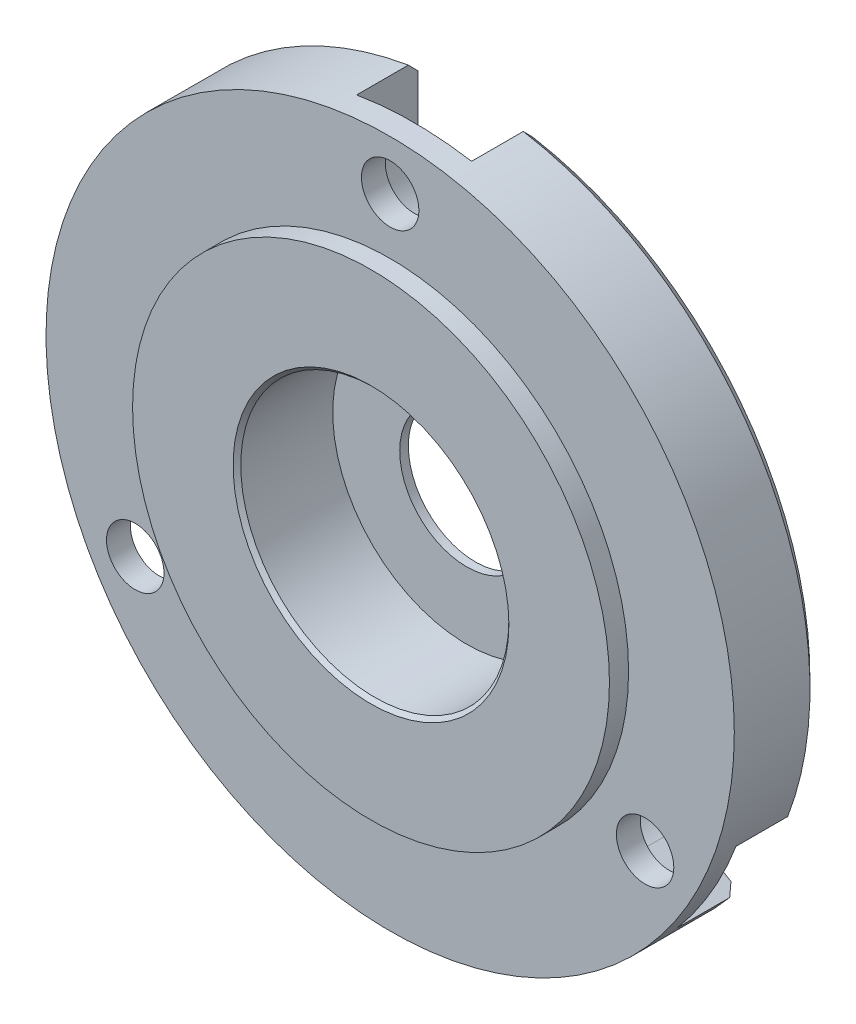
ISO-10303-21;
HEADER;
FILE_DESCRIPTION(('STEP AP214'),'2;1');
FILE_NAME('part.step','',(''),(''),'','','');
FILE_SCHEMA(('AUTOMOTIVE_DESIGN { 1 0 10303 214 1 1 1 1 }'));
ENDSEC;
DATA;
#1=APPLICATION_CONTEXT('core data for automotive mechanical design processes');
#2=APPLICATION_PROTOCOL_DEFINITION('international standard','automotive_design',2000,#1);
#3=PRODUCT_CONTEXT('',#1,'mechanical');
#4=PRODUCT('Part','Part','',(#3));
#5=PRODUCT_RELATED_PRODUCT_CATEGORY('part','',(#4));
#6=PRODUCT_DEFINITION_FORMATION('','',#4);
#7=PRODUCT_DEFINITION_CONTEXT('part definition',#1,'design');
#8=PRODUCT_DEFINITION('design','',#6,#7);
#9=PRODUCT_DEFINITION_SHAPE('','',#8);
#10=(LENGTH_UNIT() NAMED_UNIT(*) SI_UNIT(.MILLI.,.METRE.));
#11=(NAMED_UNIT(*) PLANE_ANGLE_UNIT() SI_UNIT($,.RADIAN.));
#12=(NAMED_UNIT(*) SI_UNIT($,.STERADIAN.) SOLID_ANGLE_UNIT());
#13=UNCERTAINTY_MEASURE_WITH_UNIT(LENGTH_MEASURE(1.E-05),#10,'distance_accuracy_value','');
#14=(GEOMETRIC_REPRESENTATION_CONTEXT(3) GLOBAL_UNCERTAINTY_ASSIGNED_CONTEXT((#13)) GLOBAL_UNIT_ASSIGNED_CONTEXT((#10,
#11,#12)) REPRESENTATION_CONTEXT('',''));
#15=CARTESIAN_POINT('',(0.,0.,0.));
#16=DIRECTION('',(0.,0.,1.));
#17=DIRECTION('',(1.,0.,0.));
#18=AXIS2_PLACEMENT_3D('',#15,#16,#17);
#19=CARTESIAN_POINT('',(-74.8422031977456,51.8720779220779,0.500000000000004));
#20=DIRECTION('',(0.,0.,1.));
#21=DIRECTION('',(1.,0.,0.));
#22=AXIS2_PLACEMENT_3D('',#19,#20,#21);
#23=CONICAL_SURFACE('',#22,17.97,0.785398163397448);
#24=CARTESIAN_POINT('',(-88.2002208778621,40.6134245524384,-0.000199999999997867));
#25=CARTESIAN_POINT('',(-88.2735733593311,40.5710744775165,0.0831814825688447));
#26=CARTESIAN_POINT('',(-88.3469179438918,40.5287289618768,0.166572223860307));
#27=CARTESIAN_POINT('',(-88.4935913191717,40.444047049176,0.333372223860313));
#28=CARTESIAN_POINT('',(-88.566920109891,40.4017106521149,0.416781482568851));
#29=CARTESIAN_POINT('',(-88.6402410037019,40.359378814336,0.500200000000002));
#30=B_SPLINE_CURVE_WITH_KNOTS('',3,(#24,#25,#26,#27,#28,#29),.UNSPECIFIED.,.F.,.F.,(4,2,4),(0.,
0.356565952680265,0.713131905240145),.UNSPECIFIED.);
#31=CARTESIAN_POINT('',(-88.2003968232458,40.6133229703238,0.));
#32=VERTEX_POINT('',#31);
#33=CARTESIAN_POINT('',(-88.6400652121353,40.3594803076443,0.500000000000008));
#34=VERTEX_POINT('',#33);
#35=EDGE_CURVE('E357',#32,#34,#30,.T.);
#36=ORIENTED_EDGE('',*,*,#35,.F.);
#37=CARTESIAN_POINT('',(-74.8422031977456,51.8720779220779,0.));
#38=DIRECTION('',(0.,0.,1.));
#39=DIRECTION('',(1.,0.,0.));
#40=AXIS2_PLACEMENT_3D('',#37,#38,#39);
#41=CIRCLE('',#40,17.47);
#42=CARTESIAN_POINT('',(-61.4977207946703,40.5970750664679,0.));
#43=VERTEX_POINT('',#42);
#44=EDGE_CURVE('E269',#43,#32,#41,.F.);
#45=ORIENTED_EDGE('',*,*,#44,.F.);
#46=CARTESIAN_POINT('',(-61.0635427554935,40.3361945810799,0.500200000000005));
#47=CARTESIAN_POINT('',(-61.1359218595241,40.3796843343324,0.416784823088143));
#48=CARTESIAN_POINT('',(-61.2083073868908,40.4231779471146,0.333377234636964));
#49=CARTESIAN_POINT('',(-61.3530912883131,40.5101728917485,0.166577234636959));
#50=CARTESIAN_POINT('',(-61.4254896623686,40.5536742236001,0.0831848230881354));
#51=CARTESIAN_POINT('',(-61.4978944597603,40.5971794149814,-0.000200000000000809));
#52=B_SPLINE_CURVE_WITH_KNOTS('',3,(#46,#47,#48,#49,#50,#51),.UNSPECIFIED.,.F.,.F.,(4,2,4),(0.,
0.356080977624851,0.712161955330887),.UNSPECIFIED.);
#53=CARTESIAN_POINT('',(-61.0637162958092,40.3362988546215,0.500000000000004));
#54=VERTEX_POINT('',#53);
#55=EDGE_CURVE('E371',#54,#43,#52,.T.);
#56=ORIENTED_EDGE('',*,*,#55,.F.);
#57=CARTESIAN_POINT('',(-74.8422031977456,51.8720779220779,0.500000000000004));
#58=DIRECTION('',(0.,0.,1.));
#59=DIRECTION('',(1.,0.,0.));
#60=AXIS2_PLACEMENT_3D('',#57,#58,#59);
#61=CIRCLE('',#60,17.97);
#62=EDGE_CURVE('E55',#34,#54,#61,.T.);
#63=ORIENTED_EDGE('',*,*,#62,.F.);
#64=EDGE_LOOP('',(#36,#45,#56,#63));
#65=FACE_BOUND('',#64,.T.);
#66=ADVANCED_FACE('F32',(#65),#23,.T.);
#67=CARTESIAN_POINT('',(-88.1530136539125,44.1870779220779,5.45));
#68=DIRECTION('',(0.,0.,-1.));
#69=DIRECTION('',(-1.,0.,0.));
#70=AXIS2_PLACEMENT_3D('',#67,#68,#69);
#71=CYLINDRICAL_SURFACE('',#70,1.50000000000001);
#72=CARTESIAN_POINT('',(-88.1530136539125,44.1870779220779,4.45));
#73=DIRECTION('',(0.,0.,1.));
#74=DIRECTION('',(1.,0.,0.));
#75=AXIS2_PLACEMENT_3D('',#72,#73,#74);
#76=CIRCLE('',#75,1.50000000000001);
#77=CARTESIAN_POINT('',(-86.6530136539124,44.1870779220779,4.45));
#78=VERTEX_POINT('',#77);
#79=EDGE_CURVE('E242',#78,#78,#76,.T.);
#80=ORIENTED_EDGE('',*,*,#79,.T.);
#81=EDGE_LOOP('',(#80));
#82=FACE_BOUND('',#81,.T.);
#83=CARTESIAN_POINT('',(-88.1530136539125,44.1870779220779,3.2));
#84=DIRECTION('',(0.,0.,-1.));
#85=DIRECTION('',(-1.,0.,0.));
#86=AXIS2_PLACEMENT_3D('',#83,#84,#85);
#87=CIRCLE('',#86,1.50000000000001);
#88=CARTESIAN_POINT('',(-89.6530136539125,44.1870779220779,3.2));
#89=VERTEX_POINT('',#88);
#90=EDGE_CURVE('E171',#89,#89,#87,.F.);
#91=ORIENTED_EDGE('',*,*,#90,.F.);
#92=EDGE_LOOP('',(#91));
#93=FACE_BOUND('',#92,.T.);
#94=ADVANCED_FACE('F311',(#82,#93),#71,.F.);
#95=CARTESIAN_POINT('',(-58.4699334263535,45.7775972573485,-0.000199999999999618));
#96=CARTESIAN_POINT('',(-58.3972269334165,45.7339107889951,0.083179707136008));
#97=CARTESIAN_POINT('',(-58.3245289939025,45.6902294600567,0.166569560712443));
#98=CARTESIAN_POINT('',(-58.1791502217499,45.6028770810276,0.333369560712453));
#99=CARTESIAN_POINT('',(-58.1064693891112,45.5592060309369,0.416779707136019));
#100=CARTESIAN_POINT('',(-58.0337971098956,45.5155401202612,0.500200000000005));
#101=B_SPLINE_CURVE_WITH_KNOTS('',3,(#95,#96,#97,#98,#99,#100),.UNSPECIFIED.,.F.,.F.,(4,2,4),
(0.,0.35682243382694,0.713644867509625),.UNSPECIFIED.);
#102=CARTESIAN_POINT('',(-58.4697590266398,45.7774924674286,0.));
#103=VERTEX_POINT('',#102);
#104=CARTESIAN_POINT('',(-58.0339713427646,45.5156448099307,0.500000000000008));
#105=VERTEX_POINT('',#104);
#106=EDGE_CURVE('E358',#103,#105,#101,.T.);
#107=ORIENTED_EDGE('',*,*,#106,.F.);
#108=CARTESIAN_POINT('',(-71.8422031977456,69.0825660034776,0.));
#109=VERTEX_POINT('',#108);
#110=EDGE_CURVE('E265',#109,#103,#41,.F.);
#111=ORIENTED_EDGE('',*,*,#110,.F.);
#112=CARTESIAN_POINT('',(-71.8422031977456,73.9510229847034,4.81182701392405));
#113=CARTESIAN_POINT('',(-71.8422031977456,73.188762335671,4.05656477941625));
#114=CARTESIAN_POINT('',(-71.8422031977456,72.4262004104416,3.30160534713981));
#115=CARTESIAN_POINT('',(-71.8422031977456,70.9000867576194,1.79269394851582));
#116=CARTESIAN_POINT('',(-71.8422031977456,70.1365350340635,1.0387419780846));
#117=CARTESIAN_POINT('',(-71.8422031977456,68.9901688084127,-0.0911347826652783));
#118=CARTESIAN_POINT('',(-71.8422031977456,68.6078730218659,-0.467585764161266));
#119=CARTESIAN_POINT('',(-71.8422031977456,67.8428519948834,-1.22005090566893));
#120=CARTESIAN_POINT('',(-71.8422031977456,67.4601267545847,-1.59606506581993));
#121=CARTESIAN_POINT('',(-71.8422031977456,66.6941483008052,-2.34755852838192));
#122=CARTESIAN_POINT('',(-71.8422031977456,66.3108950851956,-2.72303782862397));
#123=CARTESIAN_POINT('',(-71.8422031977456,65.5437149731561,-3.4733083304253));
#124=CARTESIAN_POINT('',(-71.8422031977456,65.1597880759751,-3.8480995312165));
#125=CARTESIAN_POINT('',(-71.8422031977456,64.7754511392664,-4.22247040456009));
#126=B_SPLINE_CURVE_WITH_KNOTS('',3,(#112,#113,#114,#115,#116,#117,#118,#119,#120,#121,#122,
#123,#124,#125),.UNSPECIFIED.,.F.,.F.,(4,2,2,2,2,2,4),(0.,3.21918774994048,6.43836241132598,
8.04795482634141,9.65754672784897,11.2671451379849,12.8767453436743),.UNSPECIFIED.);
#127=CARTESIAN_POINT('',(-71.8422031977456,69.5898909925446,0.500000000000004));
#128=VERTEX_POINT('',#127);
#129=EDGE_CURVE('E268',#128,#109,#126,.T.);
#130=ORIENTED_EDGE('',*,*,#129,.F.);
#131=EDGE_CURVE('E260',#105,#128,#61,.T.);
#132=ORIENTED_EDGE('',*,*,#131,.F.);
#133=EDGE_LOOP('',(#107,#111,#130,#132));
#134=FACE_BOUND('',#133,.T.);
#135=ADVANCED_FACE('F314',(#134),#23,.T.);
#136=CARTESIAN_POINT('',(-61.5313927415788,44.187077922078,5.45));
#137=DIRECTION('',(0.,0.,-1.));
#138=DIRECTION('',(-1.,0.,0.));
#139=AXIS2_PLACEMENT_3D('',#136,#137,#138);
#140=CYLINDRICAL_SURFACE('',#139,1.5);
#141=CARTESIAN_POINT('',(-61.5313927415788,44.187077922078,4.45));
#142=DIRECTION('',(0.,0.,1.));
#143=DIRECTION('',(1.,0.,0.));
#144=AXIS2_PLACEMENT_3D('',#141,#142,#143);
#145=CIRCLE('',#144,1.5);
#146=CARTESIAN_POINT('',(-60.0313927415788,44.187077922078,4.45));
#147=VERTEX_POINT('',#146);
#148=EDGE_CURVE('E245',#147,#147,#145,.T.);
#149=ORIENTED_EDGE('',*,*,#148,.T.);
#150=EDGE_LOOP('',(#149));
#151=FACE_BOUND('',#150,.T.);
#152=CARTESIAN_POINT('',(-61.5313927415788,44.187077922078,3.2));
#153=DIRECTION('',(0.,0.,-1.));
#154=DIRECTION('',(-1.,0.,0.));
#155=AXIS2_PLACEMENT_3D('',#152,#153,#154);
#156=CIRCLE('',#155,1.5);
#157=CARTESIAN_POINT('',(-63.0313927415788,44.187077922078,3.2));
#158=VERTEX_POINT('',#157);
#159=EDGE_CURVE('E195',#158,#158,#156,.F.);
#160=ORIENTED_EDGE('',*,*,#159,.F.);
#161=EDGE_LOOP('',(#160));
#162=FACE_BOUND('',#161,.T.);
#163=ADVANCED_FACE('F316',(#151,#162),#140,.F.);
#164=CARTESIAN_POINT('',(-74.8422031977456,67.2420779220779,5.45));
#165=DIRECTION('',(0.,0.,-1.));
#166=DIRECTION('',(-1.,0.,0.));
#167=AXIS2_PLACEMENT_3D('',#164,#165,#166);
#168=CYLINDRICAL_SURFACE('',#167,1.5);
#169=CARTESIAN_POINT('',(-74.8422031977456,67.2420779220779,4.45));
#170=DIRECTION('',(0.,0.,1.));
#171=DIRECTION('',(1.,0.,0.));
#172=AXIS2_PLACEMENT_3D('',#169,#170,#171);
#173=CIRCLE('',#172,1.5);
#174=CARTESIAN_POINT('',(-73.3422031977456,67.2420779220779,4.45));
#175=VERTEX_POINT('',#174);
#176=EDGE_CURVE('E248',#175,#175,#173,.T.);
#177=ORIENTED_EDGE('',*,*,#176,.T.);
#178=EDGE_LOOP('',(#177));
#179=FACE_BOUND('',#178,.T.);
#180=CARTESIAN_POINT('',(-74.8422031977456,67.2420779220779,3.2));
#181=DIRECTION('',(0.,0.,-1.));
#182=DIRECTION('',(-1.,0.,0.));
#183=AXIS2_PLACEMENT_3D('',#180,#181,#182);
#184=CIRCLE('',#183,1.5);
#185=CARTESIAN_POINT('',(-76.3422031977456,67.2420779220779,3.2));
#186=VERTEX_POINT('',#185);
#187=EDGE_CURVE('E224',#186,#186,#184,.F.);
#188=ORIENTED_EDGE('',*,*,#187,.F.);
#189=EDGE_LOOP('',(#188));
#190=FACE_BOUND('',#189,.T.);
#191=ADVANCED_FACE('F309',(#179,#190),#168,.F.);
#192=CARTESIAN_POINT('',(-74.8422031977456,51.8720779220779,5.45));
#193=DIRECTION('',(0.,0.,-1.));
#194=DIRECTION('',(-1.,0.,0.));
#195=AXIS2_PLACEMENT_3D('',#192,#193,#194);
#196=CYLINDRICAL_SURFACE('',#195,3.50000000000001);
#197=CARTESIAN_POINT('',(-74.8422031977456,51.8720779220779,0.));
#198=DIRECTION('',(0.,0.,-1.));
#199=DIRECTION('',(-1.,0.,0.));
#200=AXIS2_PLACEMENT_3D('',#197,#198,#199);
#201=CIRCLE('',#200,3.50000000000001);
#202=CARTESIAN_POINT('',(-78.3422031977456,51.8720779220779,0.));
#203=VERTEX_POINT('',#202);
#204=EDGE_CURVE('E239',#203,#203,#201,.T.);
#205=ORIENTED_EDGE('',*,*,#204,.T.);
#206=EDGE_LOOP('',(#205));
#207=FACE_BOUND('',#206,.T.);
#208=CARTESIAN_POINT('',(-74.8422031977456,51.8720779220779,0.45));
#209=DIRECTION('',(0.,0.,1.));
#210=DIRECTION('',(1.,0.,0.));
#211=AXIS2_PLACEMENT_3D('',#208,#209,#210);
#212=CIRCLE('',#211,3.50000000000001);
#213=CARTESIAN_POINT('',(-71.3422031977456,51.8720779220779,0.45));
#214=VERTEX_POINT('',#213);
#215=EDGE_CURVE('E238',#214,#214,#212,.F.);
#216=ORIENTED_EDGE('',*,*,#215,.F.);
#217=EDGE_LOOP('',(#216));
#218=FACE_BOUND('',#217,.T.);
#219=ADVANCED_FACE('F305',(#207,#218),#196,.F.);
#220=CARTESIAN_POINT('',(-74.8422031977456,51.8720779220779,4.45));
#221=DIRECTION('',(0.,0.,1.));
#222=DIRECTION('',(1.,0.,0.));
#223=AXIS2_PLACEMENT_3D('',#220,#221,#222);
#224=PLANE('',#223);
#225=ORIENTED_EDGE('',*,*,#79,.F.);
#226=EDGE_LOOP('',(#225));
#227=FACE_BOUND('',#226,.T.);
#228=ORIENTED_EDGE('',*,*,#148,.F.);
#229=EDGE_LOOP('',(#228));
#230=FACE_BOUND('',#229,.T.);
#231=ORIENTED_EDGE('',*,*,#176,.F.);
#232=EDGE_LOOP('',(#231));
#233=FACE_BOUND('',#232,.T.);
#234=CARTESIAN_POINT('',(-74.8422031977456,51.8720779220779,4.45));
#235=DIRECTION('',(0.,0.,1.));
#236=DIRECTION('',(1.,0.,0.));
#237=AXIS2_PLACEMENT_3D('',#234,#235,#236);
#238=CIRCLE('',#237,17.97);
#239=CARTESIAN_POINT('',(-56.8722031977456,51.8720779220779,4.45));
#240=VERTEX_POINT('',#239);
#241=EDGE_CURVE('E255',#240,#240,#238,.T.);
#242=ORIENTED_EDGE('',*,*,#241,.T.);
#243=EDGE_LOOP('',(#242));
#244=FACE_BOUND('',#243,.T.);
#245=CARTESIAN_POINT('',(-74.8422031977456,51.8720779220779,4.45));
#246=DIRECTION('',(0.,0.,1.));
#247=DIRECTION('',(1.,0.,0.));
#248=AXIS2_PLACEMENT_3D('',#245,#246,#247);
#249=CIRCLE('',#248,12.45);
#250=CARTESIAN_POINT('',(-62.3922031977456,51.8720779220779,4.45));
#251=VERTEX_POINT('',#250);
#252=EDGE_CURVE('E251',#251,#251,#249,.T.);
#253=ORIENTED_EDGE('',*,*,#252,.F.);
#254=EDGE_LOOP('',(#253));
#255=FACE_BOUND('',#254,.T.);
#256=ADVANCED_FACE('F308',(#227,#230,#233,#244,#255),#224,.T.);
#257=CARTESIAN_POINT('',(-74.8422031977456,51.8720779220779,4.45));
#258=DIRECTION('',(0.,0.,-1.));
#259=DIRECTION('',(-1.,0.,0.));
#260=AXIS2_PLACEMENT_3D('',#257,#258,#259);
#261=CYLINDRICAL_SURFACE('',#260,17.97);
#262=CARTESIAN_POINT('',(-74.8422031977456,51.8720779220779,3.2));
#263=DIRECTION('',(0.,0.,-1.));
#264=DIRECTION('',(-1.,0.,0.));
#265=AXIS2_PLACEMENT_3D('',#262,#263,#264);
#266=CIRCLE('',#265,17.97);
#267=CARTESIAN_POINT('',(-88.6400652121353,40.3594803076443,3.2));
#268=VERTEX_POINT('',#267);
#269=CARTESIAN_POINT('',(-91.6609672281103,45.5435649458005,3.2));
#270=VERTEX_POINT('',#269);
#271=EDGE_CURVE('E149',#268,#270,#266,.T.);
#272=ORIENTED_EDGE('',*,*,#271,.F.);
#273=DIRECTION('',(0.,0.,-1.));
#274=VECTOR('',#273,1.);
#275=CARTESIAN_POINT('',(-88.6400652121353,40.3594803076443,4.45));
#276=LINE('',#275,#274);
#277=EDGE_CURVE('E175',#268,#34,#276,.T.);
#278=ORIENTED_EDGE('',*,*,#277,.T.);
#279=ORIENTED_EDGE('',*,*,#62,.T.);
#280=DIRECTION('',(0.,0.,-1.));
#281=VECTOR('',#280,1.);
#282=CARTESIAN_POINT('',(-61.0637162958092,40.3362988546215,4.45));
#283=LINE('',#282,#281);
#284=CARTESIAN_POINT('',(-61.0637162958092,40.3362988546215,3.2));
#285=VERTEX_POINT('',#284);
#286=EDGE_CURVE('E200',#54,#285,#283,.F.);
#287=ORIENTED_EDGE('',*,*,#286,.T.);
#288=CARTESIAN_POINT('',(-74.8422031977456,51.8720779220779,3.2));
#289=DIRECTION('',(0.,0.,-1.));
#290=DIRECTION('',(-1.,0.,0.));
#291=AXIS2_PLACEMENT_3D('',#288,#289,#290);
#292=CIRCLE('',#291,17.97);
#293=CARTESIAN_POINT('',(-58.0339713427646,45.5156448099307,3.2));
#294=VERTEX_POINT('',#293);
#295=EDGE_CURVE('E198',#294,#285,#292,.T.);
#296=ORIENTED_EDGE('',*,*,#295,.F.);
#297=DIRECTION('',(0.,0.,-1.));
#298=VECTOR('',#297,1.);
#299=CARTESIAN_POINT('',(-58.0339713427646,45.5156448099307,4.45));
#300=LINE('',#299,#298);
#301=EDGE_CURVE('E202',#294,#105,#300,.T.);
#302=ORIENTED_EDGE('',*,*,#301,.T.);
#303=ORIENTED_EDGE('',*,*,#131,.T.);
#304=DIRECTION('',(0.,0.,-1.));
#305=VECTOR('',#304,1.);
#306=CARTESIAN_POINT('',(-71.8422031977456,69.5898909925446,4.45));
#307=LINE('',#306,#305);
#308=CARTESIAN_POINT('',(-71.8422031977456,69.5898909925446,3.2));
#309=VERTEX_POINT('',#308);
#310=EDGE_CURVE('E229',#128,#309,#307,.F.);
#311=ORIENTED_EDGE('',*,*,#310,.T.);
#312=CARTESIAN_POINT('',(-74.8422031977456,51.8720779220779,3.2));
#313=DIRECTION('',(0.,0.,-1.));
#314=DIRECTION('',(-1.,0.,0.));
#315=AXIS2_PLACEMENT_3D('',#312,#313,#314);
#316=CIRCLE('',#315,17.97);
#317=CARTESIAN_POINT('',(-77.8422031977456,69.5898909925446,3.2));
#318=VERTEX_POINT('',#317);
#319=EDGE_CURVE('E227',#318,#309,#316,.T.);
#320=ORIENTED_EDGE('',*,*,#319,.F.);
#321=DIRECTION('',(0.,0.,-1.));
#322=VECTOR('',#321,1.);
#323=CARTESIAN_POINT('',(-77.8422031977456,69.5898909925446,4.45));
#324=LINE('',#323,#322);
#325=CARTESIAN_POINT('',(-77.8422031977456,69.5898909925446,0.500000000000008));
#326=VERTEX_POINT('',#325);
#327=EDGE_CURVE('E232',#318,#326,#324,.T.);
#328=ORIENTED_EDGE('',*,*,#327,.T.);
#329=CARTESIAN_POINT('',(-91.6609672281103,45.5435649458005,0.500000000000004));
#330=VERTEX_POINT('',#329);
#331=EDGE_CURVE('E261',#326,#330,#61,.T.);
#332=ORIENTED_EDGE('',*,*,#331,.T.);
#333=DIRECTION('',(0.,0.,-1.));
#334=VECTOR('',#333,1.);
#335=CARTESIAN_POINT('',(-91.6609672281103,45.5435649458005,4.45));
#336=LINE('',#335,#334);
#337=EDGE_CURVE('E47',#330,#270,#336,.F.);
#338=ORIENTED_EDGE('',*,*,#337,.T.);
#339=EDGE_LOOP('',(#272,#278,#279,#287,#296,#302,#303,#311,#320,#328,#332,#338));
#340=FACE_BOUND('',#339,.T.);
#341=ORIENTED_EDGE('',*,*,#241,.F.);
#342=EDGE_LOOP('',(#341));
#343=FACE_BOUND('',#342,.T.);
#344=ADVANCED_FACE('F334',(#340,#343),#261,.T.);
#345=CARTESIAN_POINT('',(-74.8422031977456,51.8720779220779,0.));
#346=DIRECTION('',(0.,0.,1.));
#347=DIRECTION('',(1.,0.,0.));
#348=AXIS2_PLACEMENT_3D('',#345,#346,#347);
#349=PLANE('',#348);
#350=ORIENTED_EDGE('',*,*,#204,.F.);
#351=EDGE_LOOP('',(#350));
#352=FACE_BOUND('',#351,.T.);
#353=ORIENTED_EDGE('',*,*,#44,.T.);
#354=DIRECTION('',(-0.86602540378444,-0.499999999999998,0.));
#355=VECTOR('',#354,1.);
#356=CARTESIAN_POINT('',(-89.3713389427206,39.9372792224396,0.));
#357=LINE('',#356,#355);
#358=CARTESIAN_POINT('',(-85.8654510915531,41.9614045170597,0.));
#359=VERTEX_POINT('',#358);
#360=EDGE_CURVE('E150',#359,#32,#357,.T.);
#361=ORIENTED_EDGE('',*,*,#360,.F.);
#362=CARTESIAN_POINT('',(-87.365451091553,44.5594807284128,0.));
#363=DIRECTION('',(0.,0.,-1.));
#364=DIRECTION('',(-1.,0.,0.));
#365=AXIS2_PLACEMENT_3D('',#362,#363,#364);
#366=CIRCLE('',#365,2.99999999999972);
#367=CARTESIAN_POINT('',(-88.8654510915528,47.1575569397659,0.));
#368=VERTEX_POINT('',#367);
#369=EDGE_CURVE('E168',#368,#359,#366,.T.);
#370=ORIENTED_EDGE('',*,*,#369,.F.);
#371=DIRECTION('',(0.866025403784438,0.5,0.));
#372=VECTOR('',#371,1.);
#373=CARTESIAN_POINT('',(-92.3713389427203,45.1334316451457,0.));
#374=LINE('',#373,#372);
#375=CARTESIAN_POINT('',(-91.2219149928599,45.7970518720106,0.));
#376=VERTEX_POINT('',#375);
#377=EDGE_CURVE('E156',#376,#368,#374,.T.);
#378=ORIENTED_EDGE('',*,*,#377,.F.);
#379=CARTESIAN_POINT('',(-77.8422031977456,69.0825660034776,0.));
#380=VERTEX_POINT('',#379);
#381=EDGE_CURVE('E264',#376,#380,#41,.F.);
#382=ORIENTED_EDGE('',*,*,#381,.T.);
#383=DIRECTION('',(0.,1.,0.));
#384=VECTOR('',#383,1.);
#385=CARTESIAN_POINT('',(-77.8422031977456,70.4119051335084,0.));
#386=LINE('',#385,#384);
#387=CARTESIAN_POINT('',(-77.8422031977456,66.3636545442682,0.));
#388=VERTEX_POINT('',#387);
#389=EDGE_CURVE('E209',#388,#380,#386,.T.);
#390=ORIENTED_EDGE('',*,*,#389,.F.);
#391=CARTESIAN_POINT('',(-74.8422031977456,66.3636545442682,0.));
#392=DIRECTION('',(0.,0.,-1.));
#393=DIRECTION('',(-1.,0.,0.));
#394=AXIS2_PLACEMENT_3D('',#391,#392,#393);
#395=CIRCLE('',#394,3.);
#396=CARTESIAN_POINT('',(-71.8422031977456,66.3636545442682,0.));
#397=VERTEX_POINT('',#396);
#398=EDGE_CURVE('E217',#397,#388,#395,.T.);
#399=ORIENTED_EDGE('',*,*,#398,.F.);
#400=DIRECTION('',(0.,-1.,0.));
#401=VECTOR('',#400,1.);
#402=CARTESIAN_POINT('',(-71.8422031977456,70.4119051335084,0.));
#403=LINE('',#402,#401);
#404=EDGE_CURVE('E205',#109,#397,#403,.T.);
#405=ORIENTED_EDGE('',*,*,#404,.F.);
#406=ORIENTED_EDGE('',*,*,#110,.T.);
#407=DIRECTION('',(0.857167300702106,-0.515038074910064,0.));
#408=VECTOR('',#407,1.);
#409=CARTESIAN_POINT('',(-57.2893259383132,45.0682167112561,0.));
#410=LINE('',#409,#408);
#411=CARTESIAN_POINT('',(-60.759353968458,47.1532199014919,0.));
#412=VERTEX_POINT('',#411);
#413=EDGE_CURVE('E181',#412,#103,#410,.T.);
#414=ORIENTED_EDGE('',*,*,#413,.F.);
#415=CARTESIAN_POINT('',(-62.304468193188,44.5817179993859,0.));
#416=DIRECTION('',(0.,0.,-1.));
#417=DIRECTION('',(-1.,0.,0.));
#418=AXIS2_PLACEMENT_3D('',#415,#416,#417);
#419=CIRCLE('',#418,2.99999999999965);
#420=CARTESIAN_POINT('',(-63.8495824179181,42.0102160972799,0.));
#421=VERTEX_POINT('',#420);
#422=EDGE_CURVE('E189',#421,#412,#419,.T.);
#423=ORIENTED_EDGE('',*,*,#422,.F.);
#424=DIRECTION('',(-0.857167300702095,0.515038074910083,0.));
#425=VECTOR('',#424,1.);
#426=CARTESIAN_POINT('',(-60.3795543877733,39.9252129070439,0.));
#427=LINE('',#426,#425);
#428=EDGE_CURVE('E177',#43,#421,#427,.T.);
#429=ORIENTED_EDGE('',*,*,#428,.F.);
#430=EDGE_LOOP('',(#353,#361,#370,#378,#382,#390,#399,#405,#406,#414,#423,#429));
#431=FACE_BOUND('',#430,.T.);
#432=ADVANCED_FACE('F330',(#352,#431),#349,.F.);
#433=CARTESIAN_POINT('',(-74.8422031977456,51.8720779220779,5.45));
#434=DIRECTION('',(0.,0.,-1.));
#435=DIRECTION('',(-1.,0.,0.));
#436=AXIS2_PLACEMENT_3D('',#433,#434,#435);
#437=CYLINDRICAL_SURFACE('',#436,12.45);
#438=CARTESIAN_POINT('',(-74.8422031977456,51.8720779220779,5.45));
#439=DIRECTION('',(0.,0.,1.));
#440=DIRECTION('',(1.,0.,0.));
#441=AXIS2_PLACEMENT_3D('',#438,#439,#440);
#442=CIRCLE('',#441,12.45);
#443=CARTESIAN_POINT('',(-62.3922031977456,51.8720779220779,5.45));
#444=VERTEX_POINT('',#443);
#445=EDGE_CURVE('E252',#444,#444,#442,.T.);
#446=ORIENTED_EDGE('',*,*,#445,.F.);
#447=EDGE_LOOP('',(#446));
#448=FACE_BOUND('',#447,.T.);
#449=ORIENTED_EDGE('',*,*,#252,.T.);
#450=EDGE_LOOP('',(#449));
#451=FACE_BOUND('',#450,.T.);
#452=ADVANCED_FACE('F326',(#448,#451),#437,.T.);
#453=CARTESIAN_POINT('',(-74.8422031977456,51.8720779220779,5.45));
#454=DIRECTION('',(0.,0.,1.));
#455=DIRECTION('',(1.,0.,0.));
#456=AXIS2_PLACEMENT_3D('',#453,#454,#455);
#457=PLANE('',#456);
#458=CARTESIAN_POINT('',(-74.8422031977456,51.8720779220779,5.45));
#459=DIRECTION('',(0.,0.,1.));
#460=DIRECTION('',(1.,0.,0.));
#461=AXIS2_PLACEMENT_3D('',#458,#459,#460);
#462=CIRCLE('',#461,7.20000000000001);
#463=CARTESIAN_POINT('',(-67.6422031977456,51.8720779220779,5.45));
#464=VERTEX_POINT('',#463);
#465=EDGE_CURVE('E11',#464,#464,#462,.F.);
#466=ORIENTED_EDGE('',*,*,#465,.T.);
#467=EDGE_LOOP('',(#466));
#468=FACE_BOUND('',#467,.T.);
#469=ORIENTED_EDGE('',*,*,#445,.T.);
#470=EDGE_LOOP('',(#469));
#471=FACE_BOUND('',#470,.T.);
#472=ADVANCED_FACE('F323',(#468,#471),#457,.T.);
#473=CARTESIAN_POINT('',(-91.6611427803738,45.5434635906539,0.500200000000002));
#474=CARTESIAN_POINT('',(-91.5879231890765,45.5857369413993,0.416783231881546));
#475=CARTESIAN_POINT('',(-91.5146964368445,45.6280144265123,0.333374847828105));
#476=CARTESIAN_POINT('',(-91.368228610491,45.7125776654851,0.166574847828097));
#477=CARTESIAN_POINT('',(-91.2949875363695,45.754863419345,0.0831832318815355));
#478=CARTESIAN_POINT('',(-91.2217393013132,45.7971533075724,-0.000200000000007814));
#479=B_SPLINE_CURVE_WITH_KNOTS('',3,(#473,#474,#475,#476,#477,#478),.UNSPECIFIED.,.F.,.F.,(4,2,
4),(0.,0.356312382163325,0.712624764425558),.UNSPECIFIED.);
#480=EDGE_CURVE('E355',#330,#376,#479,.T.);
#481=ORIENTED_EDGE('',*,*,#480,.F.);
#482=ORIENTED_EDGE('',*,*,#331,.F.);
#483=CARTESIAN_POINT('',(-77.8422031977456,64.7754511392664,-4.22247040456009));
#484=CARTESIAN_POINT('',(-77.8422031977456,65.1597880759751,-3.84809953121651));
#485=CARTESIAN_POINT('',(-77.8422031977456,65.5437149731561,-3.47330833042531));
#486=CARTESIAN_POINT('',(-77.8422031977456,66.3108950851956,-2.72303782862398));
#487=CARTESIAN_POINT('',(-77.8422031977456,66.6941483008051,-2.34755852838192));
#488=CARTESIAN_POINT('',(-77.8422031977456,67.4601267545847,-1.59606506581993));
#489=CARTESIAN_POINT('',(-77.8422031977456,67.8428519948834,-1.22005090566894));
#490=CARTESIAN_POINT('',(-77.8422031977456,68.6078730218659,-0.467585764161275));
#491=CARTESIAN_POINT('',(-77.8422031977456,68.9901688084127,-0.0911347826652836));
#492=CARTESIAN_POINT('',(-77.8422031977456,70.1365350340635,1.0387419780846));
#493=CARTESIAN_POINT('',(-77.8422031977456,70.9000867576194,1.79269394851582));
#494=CARTESIAN_POINT('',(-77.8422031977456,72.4262004104416,3.30160534713981));
#495=CARTESIAN_POINT('',(-77.8422031977456,73.188762335671,4.05656477941625));
#496=CARTESIAN_POINT('',(-77.8422031977456,73.9510229847034,4.81182701392405));
#497=B_SPLINE_CURVE_WITH_KNOTS('',3,(#483,#484,#485,#486,#487,#488,#489,#490,#491,#492,#493,
#494,#495,#496),.UNSPECIFIED.,.F.,.F.,(4,2,2,2,2,2,4),(0.,1.60960020568941,3.21919861582532,
4.82879051733288,6.43838293234831,9.65755759373382,12.8767453436743),.UNSPECIFIED.);
#498=EDGE_CURVE('E279',#380,#326,#497,.T.);
#499=ORIENTED_EDGE('',*,*,#498,.F.);
#500=ORIENTED_EDGE('',*,*,#381,.F.);
#501=EDGE_LOOP('',(#481,#482,#499,#500));
#502=FACE_BOUND('',#501,.T.);
#503=ADVANCED_FACE('F285',(#502),#23,.T.);
#504=CARTESIAN_POINT('',(-74.8422031977456,51.8720779220779,0.45));
#505=DIRECTION('',(0.,0.,1.));
#506=DIRECTION('',(1.,0.,0.));
#507=AXIS2_PLACEMENT_3D('',#504,#505,#506);
#508=PLANE('',#507);
#509=CARTESIAN_POINT('',(-74.8422031977456,51.8720779220779,0.45));
#510=DIRECTION('',(0.,0.,1.));
#511=DIRECTION('',(1.,0.,0.));
#512=AXIS2_PLACEMENT_3D('',#509,#510,#511);
#513=CIRCLE('',#512,7.);
#514=CARTESIAN_POINT('',(-67.8422031977456,51.8720779220779,0.45));
#515=VERTEX_POINT('',#514);
#516=EDGE_CURVE('E235',#515,#515,#513,.T.);
#517=ORIENTED_EDGE('',*,*,#516,.T.);
#518=EDGE_LOOP('',(#517));
#519=FACE_BOUND('',#518,.T.);
#520=ORIENTED_EDGE('',*,*,#215,.T.);
#521=EDGE_LOOP('',(#520));
#522=FACE_BOUND('',#521,.T.);
#523=ADVANCED_FACE('F297',(#519,#522),#508,.T.);
#524=CARTESIAN_POINT('',(-74.8422031977456,51.8720779220779,0.45));
#525=DIRECTION('',(0.,0.,1.));
#526=DIRECTION('',(1.,0.,0.));
#527=AXIS2_PLACEMENT_3D('',#524,#525,#526);
#528=CYLINDRICAL_SURFACE('',#527,7.);
#529=CARTESIAN_POINT('',(-74.8422031977456,51.8720779220779,5.24999999999998));
#530=DIRECTION('',(0.,0.,1.));
#531=DIRECTION('',(1.,0.,0.));
#532=AXIS2_PLACEMENT_3D('',#529,#530,#531);
#533=CIRCLE('',#532,7.);
#534=CARTESIAN_POINT('',(-67.8422031977456,51.8720779220779,5.24999999999998));
#535=VERTEX_POINT('',#534);
#536=EDGE_CURVE('E40',#535,#535,#533,.T.);
#537=ORIENTED_EDGE('',*,*,#536,.T.);
#538=EDGE_LOOP('',(#537));
#539=FACE_BOUND('',#538,.T.);
#540=ORIENTED_EDGE('',*,*,#516,.F.);
#541=EDGE_LOOP('',(#540));
#542=FACE_BOUND('',#541,.T.);
#543=ADVANCED_FACE('F300',(#539,#542),#528,.F.);
#544=CARTESIAN_POINT('',(-77.8422031977456,70.4119051335084,3.2));
#545=DIRECTION('',(-1.,0.,0.));
#546=DIRECTION('',(0.,0.,1.));
#547=AXIS2_PLACEMENT_3D('',#544,#545,#546);
#548=PLANE('',#547);
#549=DIRECTION('',(0.,1.,0.));
#550=VECTOR('',#549,1.);
#551=CARTESIAN_POINT('',(-77.8422031977456,70.4119051335084,3.2));
#552=LINE('',#551,#550);
#553=CARTESIAN_POINT('',(-77.8422031977456,66.3636545442682,3.2));
#554=VERTEX_POINT('',#553);
#555=EDGE_CURVE('E212',#554,#318,#552,.T.);
#556=ORIENTED_EDGE('',*,*,#555,.F.);
#557=DIRECTION('',(0.,0.,-1.));
#558=VECTOR('',#557,1.);
#559=CARTESIAN_POINT('',(-77.8422031977456,66.3636545442682,3.2));
#560=LINE('',#559,#558);
#561=EDGE_CURVE('E222',#554,#388,#560,.T.);
#562=ORIENTED_EDGE('',*,*,#561,.T.);
#563=ORIENTED_EDGE('',*,*,#389,.T.);
#564=ORIENTED_EDGE('',*,*,#498,.T.);
#565=ORIENTED_EDGE('',*,*,#327,.F.);
#566=EDGE_LOOP('',(#556,#562,#563,#564,#565));
#567=FACE_BOUND('',#566,.T.);
#568=ADVANCED_FACE('F294',(#567),#548,.F.);
#569=CARTESIAN_POINT('',(-71.8422031977456,70.4119051335084,3.2));
#570=DIRECTION('',(1.,0.,0.));
#571=DIRECTION('',(0.,0.,-1.));
#572=AXIS2_PLACEMENT_3D('',#569,#570,#571);
#573=PLANE('',#572);
#574=ORIENTED_EDGE('',*,*,#129,.T.);
#575=ORIENTED_EDGE('',*,*,#404,.T.);
#576=DIRECTION('',(0.,0.,-1.));
#577=VECTOR('',#576,1.);
#578=CARTESIAN_POINT('',(-71.8422031977456,66.3636545442682,3.2));
#579=LINE('',#578,#577);
#580=CARTESIAN_POINT('',(-71.8422031977456,66.3636545442682,3.2));
#581=VERTEX_POINT('',#580);
#582=EDGE_CURVE('E215',#581,#397,#579,.T.);
#583=ORIENTED_EDGE('',*,*,#582,.F.);
#584=DIRECTION('',(0.,-1.,0.));
#585=VECTOR('',#584,1.);
#586=CARTESIAN_POINT('',(-71.8422031977456,70.4119051335084,3.2));
#587=LINE('',#586,#585);
#588=EDGE_CURVE('E206',#309,#581,#587,.T.);
#589=ORIENTED_EDGE('',*,*,#588,.F.);
#590=ORIENTED_EDGE('',*,*,#310,.F.);
#591=EDGE_LOOP('',(#574,#575,#583,#589,#590));
#592=FACE_BOUND('',#591,.T.);
#593=ADVANCED_FACE('F288',(#592),#573,.F.);
#594=CARTESIAN_POINT('',(-74.8422031977456,66.3636545442682,3.2));
#595=DIRECTION('',(0.,0.,-1.));
#596=DIRECTION('',(-1.,0.,0.));
#597=AXIS2_PLACEMENT_3D('',#594,#595,#596);
#598=PLANE('',#597);
#599=ORIENTED_EDGE('',*,*,#187,.T.);
#600=EDGE_LOOP('',(#599));
#601=FACE_BOUND('',#600,.T.);
#602=ORIENTED_EDGE('',*,*,#319,.T.);
#603=ORIENTED_EDGE('',*,*,#588,.T.);
#604=CARTESIAN_POINT('',(-74.8422031977456,66.3636545442682,3.2));
#605=DIRECTION('',(0.,0.,-1.));
#606=DIRECTION('',(-1.,0.,0.));
#607=AXIS2_PLACEMENT_3D('',#604,#605,#606);
#608=CIRCLE('',#607,3.);
#609=EDGE_CURVE('E208',#581,#554,#608,.T.);
#610=ORIENTED_EDGE('',*,*,#609,.T.);
#611=ORIENTED_EDGE('',*,*,#555,.T.);
#612=EDGE_LOOP('',(#602,#603,#610,#611));
#613=FACE_BOUND('',#612,.T.);
#614=ADVANCED_FACE('F293',(#601,#613),#598,.T.);
#615=CARTESIAN_POINT('',(-74.8422031977456,66.3636545442682,3.2));
#616=DIRECTION('',(0.,0.,-1.));
#617=DIRECTION('',(-1.,0.,0.));
#618=AXIS2_PLACEMENT_3D('',#615,#616,#617);
#619=CYLINDRICAL_SURFACE('',#618,3.);
#620=ORIENTED_EDGE('',*,*,#398,.T.);
#621=ORIENTED_EDGE('',*,*,#561,.F.);
#622=ORIENTED_EDGE('',*,*,#609,.F.);
#623=ORIENTED_EDGE('',*,*,#582,.T.);
#624=EDGE_LOOP('',(#620,#621,#622,#623));
#625=FACE_BOUND('',#624,.T.);
#626=ADVANCED_FACE('F296',(#625),#619,.F.);
#627=CARTESIAN_POINT('',(-57.2893259383132,45.0682167112561,3.2));
#628=DIRECTION('',(0.515038074910064,0.857167300702106,0.));
#629=DIRECTION('',(-0.857167300702107,0.515038074910064,0.));
#630=AXIS2_PLACEMENT_3D('',#627,#628,#629);
#631=PLANE('',#630);
#632=DIRECTION('',(0.857167300702106,-0.515038074910064,0.));
#633=VECTOR('',#632,1.);
#634=CARTESIAN_POINT('',(-57.2893259383132,45.0682167112561,3.2));
#635=LINE('',#634,#633);
#636=CARTESIAN_POINT('',(-60.759353968458,47.1532199014919,3.2));
#637=VERTEX_POINT('',#636);
#638=EDGE_CURVE('E184',#637,#294,#635,.T.);
#639=ORIENTED_EDGE('',*,*,#638,.F.);
#640=DIRECTION('',(0.,0.,-1.));
#641=VECTOR('',#640,1.);
#642=CARTESIAN_POINT('',(-60.759353968458,47.1532199014919,3.2));
#643=LINE('',#642,#641);
#644=EDGE_CURVE('E193',#637,#412,#643,.T.);
#645=ORIENTED_EDGE('',*,*,#644,.T.);
#646=ORIENTED_EDGE('',*,*,#413,.T.);
#647=ORIENTED_EDGE('',*,*,#106,.T.);
#648=ORIENTED_EDGE('',*,*,#301,.F.);
#649=EDGE_LOOP('',(#639,#645,#646,#647,#648));
#650=FACE_BOUND('',#649,.T.);
#651=ADVANCED_FACE('F392',(#650),#631,.F.);
#652=CARTESIAN_POINT('',(-60.3795543877733,39.9252129070439,3.2));
#653=DIRECTION('',(-0.515038074910083,-0.857167300702095,0.));
#654=DIRECTION('',(0.857167300702095,-0.515038074910083,0.));
#655=AXIS2_PLACEMENT_3D('',#652,#653,#654);
#656=PLANE('',#655);
#657=ORIENTED_EDGE('',*,*,#55,.T.);
#658=ORIENTED_EDGE('',*,*,#428,.T.);
#659=DIRECTION('',(0.,0.,-1.));
#660=VECTOR('',#659,1.);
#661=CARTESIAN_POINT('',(-63.8495824179181,42.0102160972799,3.2));
#662=LINE('',#661,#660);
#663=CARTESIAN_POINT('',(-63.8495824179181,42.0102160972799,3.2));
#664=VERTEX_POINT('',#663);
#665=EDGE_CURVE('E187',#664,#421,#662,.T.);
#666=ORIENTED_EDGE('',*,*,#665,.F.);
#667=DIRECTION('',(-0.857167300702095,0.515038074910083,0.));
#668=VECTOR('',#667,1.);
#669=CARTESIAN_POINT('',(-60.3795543877733,39.9252129070439,3.2));
#670=LINE('',#669,#668);
#671=EDGE_CURVE('E178',#285,#664,#670,.T.);
#672=ORIENTED_EDGE('',*,*,#671,.F.);
#673=ORIENTED_EDGE('',*,*,#286,.F.);
#674=EDGE_LOOP('',(#657,#658,#666,#672,#673));
#675=FACE_BOUND('',#674,.T.);
#676=ADVANCED_FACE('F386',(#675),#656,.F.);
#677=CARTESIAN_POINT('',(-62.304468193188,44.5817179993859,3.2));
#678=DIRECTION('',(0.,0.,-1.));
#679=DIRECTION('',(-1.,0.,0.));
#680=AXIS2_PLACEMENT_3D('',#677,#678,#679);
#681=PLANE('',#680);
#682=ORIENTED_EDGE('',*,*,#159,.T.);
#683=EDGE_LOOP('',(#682));
#684=FACE_BOUND('',#683,.T.);
#685=ORIENTED_EDGE('',*,*,#295,.T.);
#686=ORIENTED_EDGE('',*,*,#671,.T.);
#687=CARTESIAN_POINT('',(-62.304468193188,44.5817179993859,3.2));
#688=DIRECTION('',(0.,0.,-1.));
#689=DIRECTION('',(-1.,0.,0.));
#690=AXIS2_PLACEMENT_3D('',#687,#688,#689);
#691=CIRCLE('',#690,2.99999999999965);
#692=EDGE_CURVE('E180',#664,#637,#691,.T.);
#693=ORIENTED_EDGE('',*,*,#692,.T.);
#694=ORIENTED_EDGE('',*,*,#638,.T.);
#695=EDGE_LOOP('',(#685,#686,#693,#694));
#696=FACE_BOUND('',#695,.T.);
#697=ADVANCED_FACE('F391',(#684,#696),#681,.T.);
#698=CARTESIAN_POINT('',(-62.304468193188,44.5817179993859,3.2));
#699=DIRECTION('',(0.,0.,-1.));
#700=DIRECTION('',(-1.,0.,0.));
#701=AXIS2_PLACEMENT_3D('',#698,#699,#700);
#702=CYLINDRICAL_SURFACE('',#701,2.99999999999965);
#703=ORIENTED_EDGE('',*,*,#422,.T.);
#704=ORIENTED_EDGE('',*,*,#644,.F.);
#705=ORIENTED_EDGE('',*,*,#692,.F.);
#706=ORIENTED_EDGE('',*,*,#665,.T.);
#707=EDGE_LOOP('',(#703,#704,#705,#706));
#708=FACE_BOUND('',#707,.T.);
#709=ADVANCED_FACE('F393',(#708),#702,.F.);
#710=CARTESIAN_POINT('',(-89.3713389427206,39.9372792224396,3.2));
#711=DIRECTION('',(0.499999999999998,-0.86602540378444,0.));
#712=DIRECTION('',(0.86602540378444,0.499999999999998,0.));
#713=AXIS2_PLACEMENT_3D('',#710,#711,#712);
#714=PLANE('',#713);
#715=DIRECTION('',(-0.86602540378444,-0.499999999999998,0.));
#716=VECTOR('',#715,1.);
#717=CARTESIAN_POINT('',(-89.3713389427206,39.9372792224396,3.2));
#718=LINE('',#717,#716);
#719=CARTESIAN_POINT('',(-85.8654510915531,41.9614045170597,3.2));
#720=VERTEX_POINT('',#719);
#721=EDGE_CURVE('E161',#720,#268,#718,.T.);
#722=ORIENTED_EDGE('',*,*,#721,.F.);
#723=DIRECTION('',(0.,0.,-1.));
#724=VECTOR('',#723,1.);
#725=CARTESIAN_POINT('',(-85.8654510915531,41.9614045170597,3.2));
#726=LINE('',#725,#724);
#727=EDGE_CURVE('E160',#720,#359,#726,.T.);
#728=ORIENTED_EDGE('',*,*,#727,.T.);
#729=ORIENTED_EDGE('',*,*,#360,.T.);
#730=ORIENTED_EDGE('',*,*,#35,.T.);
#731=ORIENTED_EDGE('',*,*,#277,.F.);
#732=EDGE_LOOP('',(#722,#728,#729,#730,#731));
#733=FACE_BOUND('',#732,.T.);
#734=ADVANCED_FACE('F438',(#733),#714,.F.);
#735=CARTESIAN_POINT('',(-92.3713389427203,45.1334316451457,3.2));
#736=DIRECTION('',(-0.5,0.866025403784438,0.));
#737=DIRECTION('',(-0.866025403784438,-0.5,0.));
#738=AXIS2_PLACEMENT_3D('',#735,#736,#737);
#739=PLANE('',#738);
#740=ORIENTED_EDGE('',*,*,#480,.T.);
#741=ORIENTED_EDGE('',*,*,#377,.T.);
#742=DIRECTION('',(0.,0.,-1.));
#743=VECTOR('',#742,1.);
#744=CARTESIAN_POINT('',(-88.8654510915528,47.1575569397659,3.2));
#745=LINE('',#744,#743);
#746=CARTESIAN_POINT('',(-88.8654510915528,47.1575569397659,3.2));
#747=VERTEX_POINT('',#746);
#748=EDGE_CURVE('E153',#747,#368,#745,.T.);
#749=ORIENTED_EDGE('',*,*,#748,.F.);
#750=DIRECTION('',(0.866025403784438,0.5,0.));
#751=VECTOR('',#750,1.);
#752=CARTESIAN_POINT('',(-92.3713389427203,45.1334316451457,3.2));
#753=LINE('',#752,#751);
#754=EDGE_CURVE('E141',#270,#747,#753,.T.);
#755=ORIENTED_EDGE('',*,*,#754,.F.);
#756=ORIENTED_EDGE('',*,*,#337,.F.);
#757=EDGE_LOOP('',(#740,#741,#749,#755,#756));
#758=FACE_BOUND('',#757,.T.);
#759=ADVANCED_FACE('F154',(#758),#739,.F.);
#760=CARTESIAN_POINT('',(-87.365451091553,44.5594807284128,3.2));
#761=DIRECTION('',(0.,0.,-1.));
#762=DIRECTION('',(-1.,0.,0.));
#763=AXIS2_PLACEMENT_3D('',#760,#761,#762);
#764=PLANE('',#763);
#765=ORIENTED_EDGE('',*,*,#90,.T.);
#766=EDGE_LOOP('',(#765));
#767=FACE_BOUND('',#766,.T.);
#768=ORIENTED_EDGE('',*,*,#271,.T.);
#769=ORIENTED_EDGE('',*,*,#754,.T.);
#770=CARTESIAN_POINT('',(-87.365451091553,44.5594807284128,3.2));
#771=DIRECTION('',(0.,0.,-1.));
#772=DIRECTION('',(-1.,0.,0.));
#773=AXIS2_PLACEMENT_3D('',#770,#771,#772);
#774=CIRCLE('',#773,2.99999999999972);
#775=EDGE_CURVE('E146',#747,#720,#774,.T.);
#776=ORIENTED_EDGE('',*,*,#775,.T.);
#777=ORIENTED_EDGE('',*,*,#721,.T.);
#778=EDGE_LOOP('',(#768,#769,#776,#777));
#779=FACE_BOUND('',#778,.T.);
#780=ADVANCED_FACE('F143',(#767,#779),#764,.T.);
#781=CARTESIAN_POINT('',(-87.365451091553,44.5594807284128,3.2));
#782=DIRECTION('',(0.,0.,-1.));
#783=DIRECTION('',(-1.,0.,0.));
#784=AXIS2_PLACEMENT_3D('',#781,#782,#783);
#785=CYLINDRICAL_SURFACE('',#784,2.99999999999972);
#786=ORIENTED_EDGE('',*,*,#369,.T.);
#787=ORIENTED_EDGE('',*,*,#727,.F.);
#788=ORIENTED_EDGE('',*,*,#775,.F.);
#789=ORIENTED_EDGE('',*,*,#748,.T.);
#790=EDGE_LOOP('',(#786,#787,#788,#789));
#791=FACE_BOUND('',#790,.T.);
#792=ADVANCED_FACE('F163',(#791),#785,.F.);
#793=CARTESIAN_POINT('',(-74.8422031977456,51.8720779220779,5.24999999999998));
#794=DIRECTION('',(0.,0.,1.));
#795=DIRECTION('',(1.,0.,0.));
#796=AXIS2_PLACEMENT_3D('',#793,#794,#795);
#797=CONICAL_SURFACE('',#796,7.,0.78539816339744);
#798=ORIENTED_EDGE('',*,*,#465,.F.);
#799=EDGE_LOOP('',(#798));
#800=FACE_BOUND('',#799,.T.);
#801=ORIENTED_EDGE('',*,*,#536,.F.);
#802=EDGE_LOOP('',(#801));
#803=FACE_BOUND('',#802,.T.);
#804=ADVANCED_FACE('F34',(#800,#803),#797,.F.);
#805=CLOSED_SHELL('',(#66,#94,#135,#163,#191,#219,#256,#344,#432,#452,#472,#503,#523,#543,#568,
#593,#614,#626,#651,#676,#697,#709,#734,#759,#780,#792,#804));
#806=MANIFOLD_SOLID_BREP('B2',#805);
#807=ADVANCED_BREP_SHAPE_REPRESENTATION('',(#18,#806),#14);
#808=SHAPE_DEFINITION_REPRESENTATION(#9,#807);
ENDSEC;
END-ISO-10303-21;
